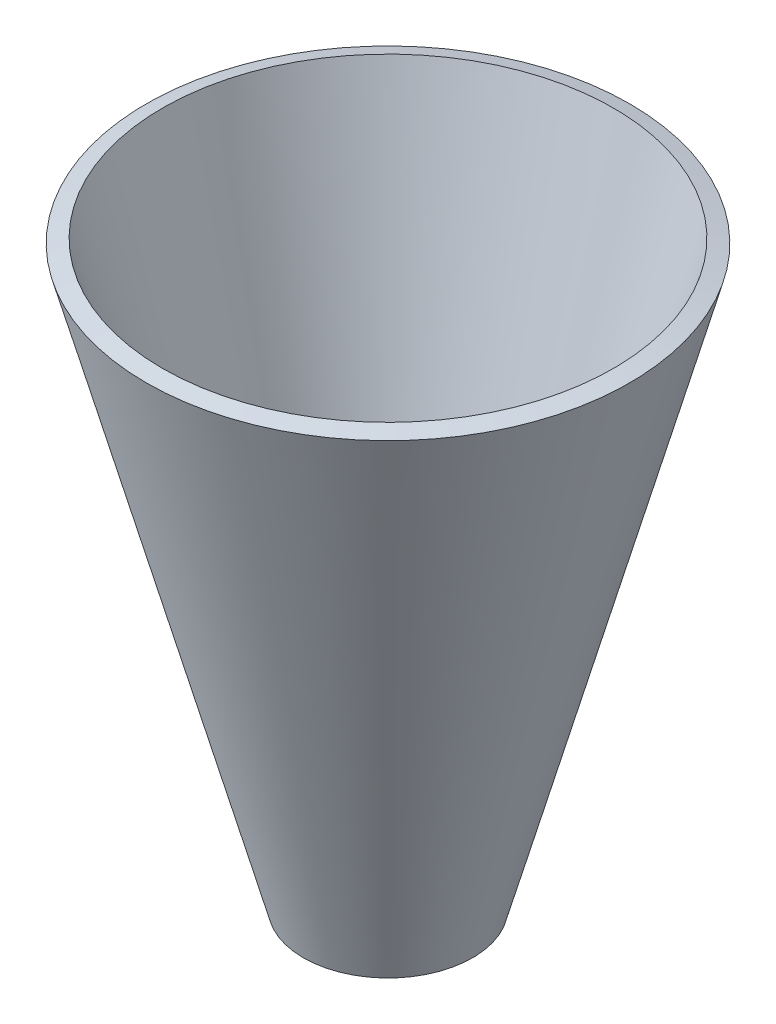
ISO-10303-21;
HEADER;
FILE_DESCRIPTION(('STEP AP214'),'2;1');
FILE_NAME('part.step','',(''),(''),'','','');
FILE_SCHEMA(('AUTOMOTIVE_DESIGN { 1 0 10303 214 1 1 1 1 }'));
ENDSEC;
DATA;
#1=APPLICATION_CONTEXT('core data for automotive mechanical design processes');
#2=APPLICATION_PROTOCOL_DEFINITION('international standard','automotive_design',2000,#1);
#3=PRODUCT_CONTEXT('',#1,'mechanical');
#4=PRODUCT('Part','Part','',(#3));
#5=PRODUCT_RELATED_PRODUCT_CATEGORY('part','',(#4));
#6=PRODUCT_DEFINITION_FORMATION('','',#4);
#7=PRODUCT_DEFINITION_CONTEXT('part definition',#1,'design');
#8=PRODUCT_DEFINITION('design','',#6,#7);
#9=PRODUCT_DEFINITION_SHAPE('','',#8);
#10=(LENGTH_UNIT() NAMED_UNIT(*) SI_UNIT(.MILLI.,.METRE.));
#11=(NAMED_UNIT(*) PLANE_ANGLE_UNIT() SI_UNIT($,.RADIAN.));
#12=(NAMED_UNIT(*) SI_UNIT($,.STERADIAN.) SOLID_ANGLE_UNIT());
#13=UNCERTAINTY_MEASURE_WITH_UNIT(LENGTH_MEASURE(1.E-05),#10,'distance_accuracy_value','');
#14=(GEOMETRIC_REPRESENTATION_CONTEXT(3) GLOBAL_UNCERTAINTY_ASSIGNED_CONTEXT((#13)) GLOBAL_UNIT_ASSIGNED_CONTEXT((#10,
#11,#12)) REPRESENTATION_CONTEXT('',''));
#15=CARTESIAN_POINT('',(0.,0.,0.));
#16=DIRECTION('',(0.,0.,1.));
#17=DIRECTION('',(1.,0.,0.));
#18=AXIS2_PLACEMENT_3D('',#15,#16,#17);
#19=CARTESIAN_POINT('',(0.,-33.3907008613141,0.));
#20=DIRECTION('',(0.,1.,0.));
#21=DIRECTION('',(0.,0.,1.));
#22=AXIS2_PLACEMENT_3D('',#19,#20,#21);
#23=CONICAL_SURFACE('',#22,10.0922865549294,0.265948743124436);
#24=CARTESIAN_POINT('',(0.,35.2935636768843,0.));
#25=DIRECTION('',(0.,1.,0.));
#26=DIRECTION('',(0.,0.,1.));
#27=AXIS2_PLACEMENT_3D('',#24,#25,#26);
#28=CIRCLE('',#27,28.8019786871985);
#29=CARTESIAN_POINT('',(0.,35.2935636768843,28.8019786871985));
#30=VERTEX_POINT('',#29);
#31=EDGE_CURVE('E51',#30,#30,#28,.T.);
#32=ORIENTED_EDGE('',*,*,#31,.F.);
#33=EDGE_LOOP('',(#32));
#34=FACE_BOUND('',#33,.T.);
#35=CARTESIAN_POINT('',(0.,-33.3907008613141,0.));
#36=DIRECTION('',(0.,1.,0.));
#37=DIRECTION('',(0.,0.,1.));
#38=AXIS2_PLACEMENT_3D('',#35,#36,#37);
#39=CIRCLE('',#38,10.0922865549294);
#40=CARTESIAN_POINT('',(0.,-33.3907008613141,10.0922865549294));
#41=VERTEX_POINT('',#40);
#42=EDGE_CURVE('E10',#41,#41,#39,.T.);
#43=ORIENTED_EDGE('',*,*,#42,.T.);
#44=EDGE_LOOP('',(#43));
#45=FACE_BOUND('',#44,.T.);
#46=ADVANCED_FACE('F37',(#34,#45),#23,.T.);
#47=CARTESIAN_POINT('',(0.,-33.3907008613141,0.));
#48=DIRECTION('',(0.,-1.,0.));
#49=DIRECTION('',(0.,0.,-1.));
#50=AXIS2_PLACEMENT_3D('',#47,#48,#49);
#51=CONICAL_SURFACE('',#50,10.0922865549294,1.30484758367046);
#52=CARTESIAN_POINT('',(0.,-32.8650513112885,0.));
#53=DIRECTION('',(0.,1.,0.));
#54=DIRECTION('',(0.,0.,1.));
#55=AXIS2_PLACEMENT_3D('',#52,#53,#54);
#56=CIRCLE('',#55,8.16259939101971);
#57=CARTESIAN_POINT('',(0.,-32.8650513112885,8.16259939101971));
#58=VERTEX_POINT('',#57);
#59=EDGE_CURVE('E43',#58,#58,#56,.T.);
#60=ORIENTED_EDGE('',*,*,#59,.T.);
#61=EDGE_LOOP('',(#60));
#62=FACE_BOUND('',#61,.T.);
#63=ORIENTED_EDGE('',*,*,#42,.F.);
#64=EDGE_LOOP('',(#63));
#65=FACE_BOUND('',#64,.T.);
#66=ADVANCED_FACE('F61',(#62,#65),#51,.F.);
#67=CARTESIAN_POINT('',(0.,-32.8650513112885,0.));
#68=DIRECTION('',(0.,1.,0.));
#69=DIRECTION('',(0.,0.,1.));
#70=AXIS2_PLACEMENT_3D('',#67,#68,#69);
#71=CONICAL_SURFACE('',#70,8.16259939101971,0.265948743124436);
#72=CARTESIAN_POINT('',(0.,35.8192132269099,0.));
#73=DIRECTION('',(0.,1.,0.));
#74=DIRECTION('',(0.,0.,1.));
#75=AXIS2_PLACEMENT_3D('',#72,#73,#74);
#76=CIRCLE('',#75,26.8722915232888);
#77=CARTESIAN_POINT('',(0.,35.8192132269099,26.8722915232888));
#78=VERTEX_POINT('',#77);
#79=EDGE_CURVE('E47',#78,#78,#76,.T.);
#80=ORIENTED_EDGE('',*,*,#79,.T.);
#81=EDGE_LOOP('',(#80));
#82=FACE_BOUND('',#81,.T.);
#83=ORIENTED_EDGE('',*,*,#59,.F.);
#84=EDGE_LOOP('',(#83));
#85=FACE_BOUND('',#84,.T.);
#86=ADVANCED_FACE('F65',(#82,#85),#71,.F.);
#87=CARTESIAN_POINT('',(0.,35.8192132269099,0.));
#88=DIRECTION('',(0.,-1.,0.));
#89=DIRECTION('',(0.,0.,-1.));
#90=AXIS2_PLACEMENT_3D('',#87,#88,#89);
#91=CONICAL_SURFACE('',#90,26.8722915232888,1.30484758367046);
#92=ORIENTED_EDGE('',*,*,#31,.T.);
#93=EDGE_LOOP('',(#92));
#94=FACE_BOUND('',#93,.T.);
#95=ORIENTED_EDGE('',*,*,#79,.F.);
#96=EDGE_LOOP('',(#95));
#97=FACE_BOUND('',#96,.T.);
#98=ADVANCED_FACE('F57',(#94,#97),#91,.T.);
#99=CLOSED_SHELL('',(#46,#66,#86,#98));
#100=MANIFOLD_SOLID_BREP('B2',#99);
#101=ADVANCED_BREP_SHAPE_REPRESENTATION('',(#18,#100),#14);
#102=SHAPE_DEFINITION_REPRESENTATION(#9,#101);
ENDSEC;
END-ISO-10303-21;
